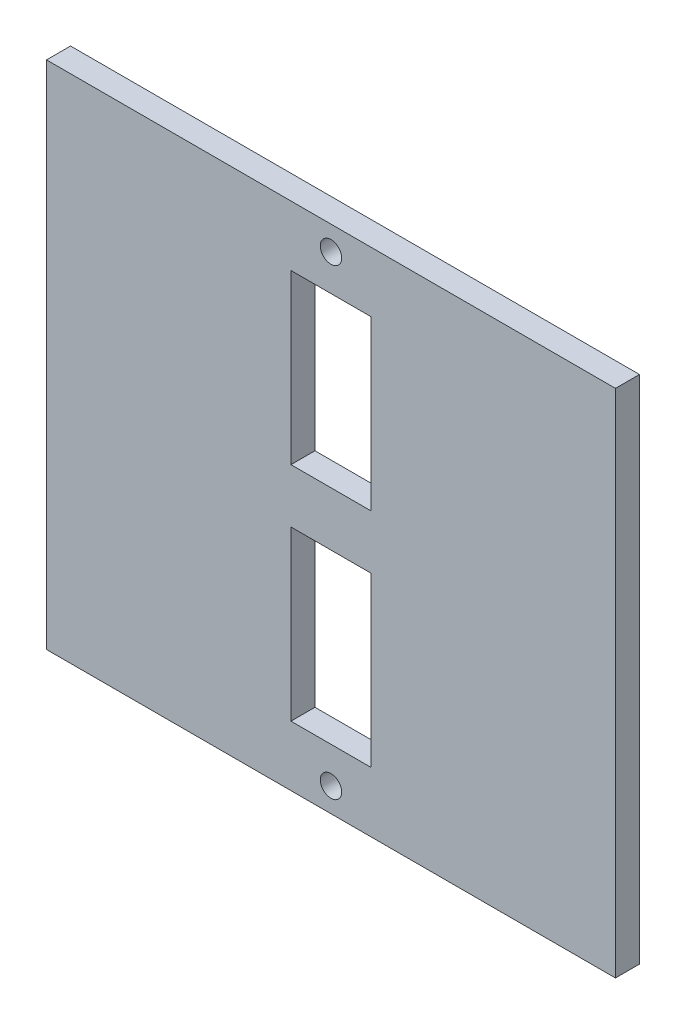
ISO-10303-21;
HEADER;
FILE_DESCRIPTION(('STEP AP214'),'2;1');
FILE_NAME('part.step','',(''),(''),'','','');
FILE_SCHEMA(('AUTOMOTIVE_DESIGN { 1 0 10303 214 1 1 1 1 }'));
ENDSEC;
DATA;
#1=APPLICATION_CONTEXT('core data for automotive mechanical design processes');
#2=APPLICATION_PROTOCOL_DEFINITION('international standard','automotive_design',2000,#1);
#3=PRODUCT_CONTEXT('',#1,'mechanical');
#4=PRODUCT('Part','Part','',(#3));
#5=PRODUCT_RELATED_PRODUCT_CATEGORY('part','',(#4));
#6=PRODUCT_DEFINITION_FORMATION('','',#4);
#7=PRODUCT_DEFINITION_CONTEXT('part definition',#1,'design');
#8=PRODUCT_DEFINITION('design','',#6,#7);
#9=PRODUCT_DEFINITION_SHAPE('','',#8);
#10=(LENGTH_UNIT() NAMED_UNIT(*) SI_UNIT(.MILLI.,.METRE.));
#11=(NAMED_UNIT(*) PLANE_ANGLE_UNIT() SI_UNIT($,.RADIAN.));
#12=(NAMED_UNIT(*) SI_UNIT($,.STERADIAN.) SOLID_ANGLE_UNIT());
#13=UNCERTAINTY_MEASURE_WITH_UNIT(LENGTH_MEASURE(1.E-05),#10,'distance_accuracy_value','');
#14=(GEOMETRIC_REPRESENTATION_CONTEXT(3) GLOBAL_UNCERTAINTY_ASSIGNED_CONTEXT((#13)) GLOBAL_UNIT_ASSIGNED_CONTEXT((#10,
#11,#12)) REPRESENTATION_CONTEXT('',''));
#15=CARTESIAN_POINT('',(0.,0.,0.));
#16=DIRECTION('',(0.,0.,1.));
#17=DIRECTION('',(1.,0.,0.));
#18=AXIS2_PLACEMENT_3D('',#15,#16,#17);
#19=CARTESIAN_POINT('',(0.,0.,3.175));
#20=DIRECTION('',(0.,0.,1.));
#21=DIRECTION('',(1.,0.,0.));
#22=AXIS2_PLACEMENT_3D('',#19,#20,#21);
#23=PLANE('',#22);
#24=CARTESIAN_POINT('',(0.,30.5530194846605,3.175));
#25=DIRECTION('',(0.,0.,1.));
#26=DIRECTION('',(1.,0.,0.));
#27=AXIS2_PLACEMENT_3D('',#24,#25,#26);
#28=CIRCLE('',#27,1.415);
#29=CARTESIAN_POINT('',(1.415,30.5530194846605,3.175));
#30=VERTEX_POINT('',#29);
#31=EDGE_CURVE('E221',#30,#30,#28,.T.);
#32=ORIENTED_EDGE('',*,*,#31,.F.);
#33=EDGE_LOOP('',(#32));
#34=FACE_BOUND('',#33,.T.);
#35=CARTESIAN_POINT('',(0.,-30.5530194846605,3.175));
#36=DIRECTION('',(0.,0.,1.));
#37=DIRECTION('',(-1.,0.,0.));
#38=AXIS2_PLACEMENT_3D('',#35,#36,#37);
#39=CIRCLE('',#38,1.415);
#40=CARTESIAN_POINT('',(-1.41499999999999,-30.5530194846605,3.175));
#41=VERTEX_POINT('',#40);
#42=EDGE_CURVE('E226',#41,#41,#39,.T.);
#43=ORIENTED_EDGE('',*,*,#42,.F.);
#44=EDGE_LOOP('',(#43));
#45=FACE_BOUND('',#44,.T.);
#46=DIRECTION('',(0.,1.,0.));
#47=VECTOR('',#46,1.);
#48=CARTESIAN_POINT('',(37.585,33.735,3.175));
#49=LINE('',#48,#47);
#50=CARTESIAN_POINT('',(37.585,-33.735,3.175));
#51=VERTEX_POINT('',#50);
#52=CARTESIAN_POINT('',(37.585,33.735,3.175));
#53=VERTEX_POINT('',#52);
#54=EDGE_CURVE('E195',#51,#53,#49,.T.);
#55=ORIENTED_EDGE('',*,*,#54,.T.);
#56=DIRECTION('',(-1.,0.,0.));
#57=VECTOR('',#56,1.);
#58=CARTESIAN_POINT('',(-37.585,33.735,3.175));
#59=LINE('',#58,#57);
#60=CARTESIAN_POINT('',(-37.585,33.735,3.175));
#61=VERTEX_POINT('',#60);
#62=EDGE_CURVE('E198',#53,#61,#59,.T.);
#63=ORIENTED_EDGE('',*,*,#62,.T.);
#64=DIRECTION('',(0.,-1.,0.));
#65=VECTOR('',#64,1.);
#66=CARTESIAN_POINT('',(-37.585,33.735,3.175));
#67=LINE('',#66,#65);
#68=CARTESIAN_POINT('',(-37.585,-33.735,3.175));
#69=VERTEX_POINT('',#68);
#70=EDGE_CURVE('E201',#61,#69,#67,.T.);
#71=ORIENTED_EDGE('',*,*,#70,.T.);
#72=DIRECTION('',(1.,0.,0.));
#73=VECTOR('',#72,1.);
#74=CARTESIAN_POINT('',(-37.585,-33.735,3.175));
#75=LINE('',#74,#73);
#76=EDGE_CURVE('E203',#69,#51,#75,.T.);
#77=ORIENTED_EDGE('',*,*,#76,.T.);
#78=EDGE_LOOP('',(#55,#63,#71,#77));
#79=FACE_BOUND('',#78,.T.);
#80=DIRECTION('',(-1.,0.,0.));
#81=VECTOR('',#80,1.);
#82=CARTESIAN_POINT('',(-5.29000000000001,25.7841584263148,3.175));
#83=LINE('',#82,#81);
#84=CARTESIAN_POINT('',(5.28999999999999,25.7841584263148,3.175));
#85=VERTEX_POINT('',#84);
#86=CARTESIAN_POINT('',(-5.29000000000001,25.7841584263148,3.175));
#87=VERTEX_POINT('',#86);
#88=EDGE_CURVE('E166',#85,#87,#83,.T.);
#89=ORIENTED_EDGE('',*,*,#88,.F.);
#90=DIRECTION('',(0.,1.,0.));
#91=VECTOR('',#90,1.);
#92=CARTESIAN_POINT('',(5.28999999999999,3.56584157368514,3.175));
#93=LINE('',#92,#91);
#94=CARTESIAN_POINT('',(5.28999999999999,3.56584157368514,3.175));
#95=VERTEX_POINT('',#94);
#96=EDGE_CURVE('E164',#95,#85,#93,.T.);
#97=ORIENTED_EDGE('',*,*,#96,.F.);
#98=DIRECTION('',(1.,0.,0.));
#99=VECTOR('',#98,1.);
#100=CARTESIAN_POINT('',(-5.29000000000001,3.56584157368514,3.175));
#101=LINE('',#100,#99);
#102=CARTESIAN_POINT('',(-5.29000000000001,3.56584157368514,3.175));
#103=VERTEX_POINT('',#102);
#104=EDGE_CURVE('E172',#103,#95,#101,.T.);
#105=ORIENTED_EDGE('',*,*,#104,.F.);
#106=DIRECTION('',(0.,-1.,0.));
#107=VECTOR('',#106,1.);
#108=CARTESIAN_POINT('',(-5.29000000000001,3.56584157368514,3.175));
#109=LINE('',#108,#107);
#110=EDGE_CURVE('E169',#87,#103,#109,.T.);
#111=ORIENTED_EDGE('',*,*,#110,.F.);
#112=EDGE_LOOP('',(#89,#97,#105,#111));
#113=FACE_BOUND('',#112,.T.);
#114=DIRECTION('',(1.,0.,0.));
#115=VECTOR('',#114,1.);
#116=CARTESIAN_POINT('',(-5.29000000000001,-25.7841584263149,3.175));
#117=LINE('',#116,#115);
#118=CARTESIAN_POINT('',(-5.29000000000001,-25.7841584263149,3.175));
#119=VERTEX_POINT('',#118);
#120=CARTESIAN_POINT('',(5.28999999999999,-25.7841584263149,3.175));
#121=VERTEX_POINT('',#120);
#122=EDGE_CURVE('E135',#119,#121,#117,.T.);
#123=ORIENTED_EDGE('',*,*,#122,.F.);
#124=DIRECTION('',(0.,-1.,0.));
#125=VECTOR('',#124,1.);
#126=CARTESIAN_POINT('',(-5.29000000000001,-3.56584157368515,3.175));
#127=LINE('',#126,#125);
#128=CARTESIAN_POINT('',(-5.29000000000001,-3.56584157368515,3.175));
#129=VERTEX_POINT('',#128);
#130=EDGE_CURVE('E127',#129,#119,#127,.T.);
#131=ORIENTED_EDGE('',*,*,#130,.F.);
#132=DIRECTION('',(-1.,0.,0.));
#133=VECTOR('',#132,1.);
#134=CARTESIAN_POINT('',(-5.29000000000001,-3.56584157368515,3.175));
#135=LINE('',#134,#133);
#136=CARTESIAN_POINT('',(5.28999999999999,-3.56584157368515,3.175));
#137=VERTEX_POINT('',#136);
#138=EDGE_CURVE('E149',#137,#129,#135,.T.);
#139=ORIENTED_EDGE('',*,*,#138,.F.);
#140=DIRECTION('',(0.,1.,0.));
#141=VECTOR('',#140,1.);
#142=CARTESIAN_POINT('',(5.28999999999999,-3.56584157368515,3.175));
#143=LINE('',#142,#141);
#144=EDGE_CURVE('E147',#121,#137,#143,.T.);
#145=ORIENTED_EDGE('',*,*,#144,.F.);
#146=EDGE_LOOP('',(#123,#131,#139,#145));
#147=FACE_BOUND('',#146,.T.);
#148=ADVANCED_FACE('F36',(#34,#45,#79,#113,#147),#23,.T.);
#149=CARTESIAN_POINT('',(0.,0.,0.));
#150=DIRECTION('',(0.,0.,1.));
#151=DIRECTION('',(1.,0.,0.));
#152=AXIS2_PLACEMENT_3D('',#149,#150,#151);
#153=PLANE('',#152);
#154=CARTESIAN_POINT('',(0.,30.5530194846605,0.));
#155=DIRECTION('',(0.,0.,1.));
#156=DIRECTION('',(1.,0.,0.));
#157=AXIS2_PLACEMENT_3D('',#154,#155,#156);
#158=CIRCLE('',#157,1.415);
#159=CARTESIAN_POINT('',(1.415,30.5530194846605,0.));
#160=VERTEX_POINT('',#159);
#161=EDGE_CURVE('E40',#160,#160,#158,.T.);
#162=ORIENTED_EDGE('',*,*,#161,.T.);
#163=EDGE_LOOP('',(#162));
#164=FACE_BOUND('',#163,.T.);
#165=CARTESIAN_POINT('',(0.,-30.5530194846605,0.));
#166=DIRECTION('',(0.,0.,1.));
#167=DIRECTION('',(1.,0.,0.));
#168=AXIS2_PLACEMENT_3D('',#165,#166,#167);
#169=CIRCLE('',#168,1.415);
#170=CARTESIAN_POINT('',(1.41500000000001,-30.5530194846605,0.));
#171=VERTEX_POINT('',#170);
#172=EDGE_CURVE('E219',#171,#171,#169,.T.);
#173=ORIENTED_EDGE('',*,*,#172,.T.);
#174=EDGE_LOOP('',(#173));
#175=FACE_BOUND('',#174,.T.);
#176=DIRECTION('',(0.,1.,0.));
#177=VECTOR('',#176,1.);
#178=CARTESIAN_POINT('',(5.28999999999999,3.56584157368514,0.));
#179=LINE('',#178,#177);
#180=CARTESIAN_POINT('',(5.28999999999999,3.56584157368514,0.));
#181=VERTEX_POINT('',#180);
#182=CARTESIAN_POINT('',(5.28999999999999,25.7841584263148,0.));
#183=VERTEX_POINT('',#182);
#184=EDGE_CURVE('E143',#181,#183,#179,.T.);
#185=ORIENTED_EDGE('',*,*,#184,.T.);
#186=DIRECTION('',(-1.,0.,0.));
#187=VECTOR('',#186,1.);
#188=CARTESIAN_POINT('',(-5.29000000000001,25.7841584263148,0.));
#189=LINE('',#188,#187);
#190=CARTESIAN_POINT('',(-5.29000000000001,25.7841584263148,0.));
#191=VERTEX_POINT('',#190);
#192=EDGE_CURVE('E177',#183,#191,#189,.T.);
#193=ORIENTED_EDGE('',*,*,#192,.T.);
#194=DIRECTION('',(0.,-1.,0.));
#195=VECTOR('',#194,1.);
#196=CARTESIAN_POINT('',(-5.29000000000001,3.56584157368514,0.));
#197=LINE('',#196,#195);
#198=CARTESIAN_POINT('',(-5.29000000000001,3.56584157368514,0.));
#199=VERTEX_POINT('',#198);
#200=EDGE_CURVE('E180',#191,#199,#197,.T.);
#201=ORIENTED_EDGE('',*,*,#200,.T.);
#202=DIRECTION('',(1.,0.,0.));
#203=VECTOR('',#202,1.);
#204=CARTESIAN_POINT('',(-5.29000000000001,3.56584157368514,0.));
#205=LINE('',#204,#203);
#206=EDGE_CURVE('E167',#199,#181,#205,.T.);
#207=ORIENTED_EDGE('',*,*,#206,.T.);
#208=EDGE_LOOP('',(#185,#193,#201,#207));
#209=FACE_BOUND('',#208,.T.);
#210=DIRECTION('',(0.,1.,0.));
#211=VECTOR('',#210,1.);
#212=CARTESIAN_POINT('',(37.585,33.735,0.));
#213=LINE('',#212,#211);
#214=CARTESIAN_POINT('',(37.585,-33.735,0.));
#215=VERTEX_POINT('',#214);
#216=CARTESIAN_POINT('',(37.585,33.735,0.));
#217=VERTEX_POINT('',#216);
#218=EDGE_CURVE('E194',#215,#217,#213,.T.);
#219=ORIENTED_EDGE('',*,*,#218,.F.);
#220=DIRECTION('',(1.,0.,0.));
#221=VECTOR('',#220,1.);
#222=CARTESIAN_POINT('',(-37.585,-33.735,0.));
#223=LINE('',#222,#221);
#224=CARTESIAN_POINT('',(-37.585,-33.735,0.));
#225=VERTEX_POINT('',#224);
#226=EDGE_CURVE('E199',#225,#215,#223,.T.);
#227=ORIENTED_EDGE('',*,*,#226,.F.);
#228=DIRECTION('',(0.,-1.,0.));
#229=VECTOR('',#228,1.);
#230=CARTESIAN_POINT('',(-37.585,33.735,0.));
#231=LINE('',#230,#229);
#232=CARTESIAN_POINT('',(-37.585,33.735,0.));
#233=VERTEX_POINT('',#232);
#234=EDGE_CURVE('E210',#233,#225,#231,.T.);
#235=ORIENTED_EDGE('',*,*,#234,.F.);
#236=DIRECTION('',(-1.,0.,0.));
#237=VECTOR('',#236,1.);
#238=CARTESIAN_POINT('',(-37.585,33.735,0.));
#239=LINE('',#238,#237);
#240=EDGE_CURVE('E208',#217,#233,#239,.T.);
#241=ORIENTED_EDGE('',*,*,#240,.F.);
#242=EDGE_LOOP('',(#219,#227,#235,#241));
#243=FACE_BOUND('',#242,.T.);
#244=DIRECTION('',(0.,-1.,0.));
#245=VECTOR('',#244,1.);
#246=CARTESIAN_POINT('',(-5.29000000000001,-3.56584157368515,0.));
#247=LINE('',#246,#245);
#248=CARTESIAN_POINT('',(-5.29000000000001,-3.56584157368515,0.));
#249=VERTEX_POINT('',#248);
#250=CARTESIAN_POINT('',(-5.29000000000001,-25.7841584263149,0.));
#251=VERTEX_POINT('',#250);
#252=EDGE_CURVE('E61',#249,#251,#247,.T.);
#253=ORIENTED_EDGE('',*,*,#252,.T.);
#254=DIRECTION('',(1.,0.,0.));
#255=VECTOR('',#254,1.);
#256=CARTESIAN_POINT('',(-5.29000000000001,-25.7841584263149,0.));
#257=LINE('',#256,#255);
#258=CARTESIAN_POINT('',(5.28999999999999,-25.7841584263149,0.));
#259=VERTEX_POINT('',#258);
#260=EDGE_CURVE('E142',#251,#259,#257,.T.);
#261=ORIENTED_EDGE('',*,*,#260,.T.);
#262=DIRECTION('',(0.,1.,0.));
#263=VECTOR('',#262,1.);
#264=CARTESIAN_POINT('',(5.28999999999999,-3.56584157368515,0.));
#265=LINE('',#264,#263);
#266=CARTESIAN_POINT('',(5.28999999999999,-3.56584157368515,0.));
#267=VERTEX_POINT('',#266);
#268=EDGE_CURVE('E156',#259,#267,#265,.T.);
#269=ORIENTED_EDGE('',*,*,#268,.T.);
#270=DIRECTION('',(-1.,0.,0.));
#271=VECTOR('',#270,1.);
#272=CARTESIAN_POINT('',(-5.29000000000001,-3.56584157368515,0.));
#273=LINE('',#272,#271);
#274=EDGE_CURVE('E136',#267,#249,#273,.T.);
#275=ORIENTED_EDGE('',*,*,#274,.T.);
#276=EDGE_LOOP('',(#253,#261,#269,#275));
#277=FACE_BOUND('',#276,.T.);
#278=ADVANCED_FACE('F238',(#164,#175,#209,#243,#277),#153,.F.);
#279=CARTESIAN_POINT('',(37.585,33.735,3.175));
#280=DIRECTION('',(-1.,0.,0.));
#281=DIRECTION('',(0.,0.,1.));
#282=AXIS2_PLACEMENT_3D('',#279,#280,#281);
#283=PLANE('',#282);
#284=ORIENTED_EDGE('',*,*,#218,.T.);
#285=DIRECTION('',(0.,0.,-1.));
#286=VECTOR('',#285,1.);
#287=CARTESIAN_POINT('',(37.585,33.735,3.175));
#288=LINE('',#287,#286);
#289=EDGE_CURVE('E11',#53,#217,#288,.T.);
#290=ORIENTED_EDGE('',*,*,#289,.F.);
#291=ORIENTED_EDGE('',*,*,#54,.F.);
#292=DIRECTION('',(0.,0.,-1.));
#293=VECTOR('',#292,1.);
#294=CARTESIAN_POINT('',(37.585,-33.735,3.175));
#295=LINE('',#294,#293);
#296=EDGE_CURVE('E205',#51,#215,#295,.T.);
#297=ORIENTED_EDGE('',*,*,#296,.T.);
#298=EDGE_LOOP('',(#284,#290,#291,#297));
#299=FACE_BOUND('',#298,.T.);
#300=ADVANCED_FACE('F38',(#299),#283,.F.);
#301=CARTESIAN_POINT('',(-37.585,33.735,3.175));
#302=DIRECTION('',(0.,-1.,0.));
#303=DIRECTION('',(0.,0.,-1.));
#304=AXIS2_PLACEMENT_3D('',#301,#302,#303);
#305=PLANE('',#304);
#306=ORIENTED_EDGE('',*,*,#240,.T.);
#307=DIRECTION('',(0.,0.,-1.));
#308=VECTOR('',#307,1.);
#309=CARTESIAN_POINT('',(-37.585,33.735,3.175));
#310=LINE('',#309,#308);
#311=EDGE_CURVE('E45',#61,#233,#310,.T.);
#312=ORIENTED_EDGE('',*,*,#311,.F.);
#313=ORIENTED_EDGE('',*,*,#62,.F.);
#314=ORIENTED_EDGE('',*,*,#289,.T.);
#315=EDGE_LOOP('',(#306,#312,#313,#314));
#316=FACE_BOUND('',#315,.T.);
#317=ADVANCED_FACE('F286',(#316),#305,.F.);
#318=CARTESIAN_POINT('',(-37.585,33.735,3.175));
#319=DIRECTION('',(1.,0.,0.));
#320=DIRECTION('',(0.,0.,-1.));
#321=AXIS2_PLACEMENT_3D('',#318,#319,#320);
#322=PLANE('',#321);
#323=ORIENTED_EDGE('',*,*,#234,.T.);
#324=DIRECTION('',(0.,0.,-1.));
#325=VECTOR('',#324,1.);
#326=CARTESIAN_POINT('',(-37.585,-33.735,3.175));
#327=LINE('',#326,#325);
#328=EDGE_CURVE('E215',#69,#225,#327,.T.);
#329=ORIENTED_EDGE('',*,*,#328,.F.);
#330=ORIENTED_EDGE('',*,*,#70,.F.);
#331=ORIENTED_EDGE('',*,*,#311,.T.);
#332=EDGE_LOOP('',(#323,#329,#330,#331));
#333=FACE_BOUND('',#332,.T.);
#334=ADVANCED_FACE('F283',(#333),#322,.F.);
#335=CARTESIAN_POINT('',(-37.585,-33.735,3.175));
#336=DIRECTION('',(0.,1.,0.));
#337=DIRECTION('',(0.,0.,1.));
#338=AXIS2_PLACEMENT_3D('',#335,#336,#337);
#339=PLANE('',#338);
#340=ORIENTED_EDGE('',*,*,#226,.T.);
#341=ORIENTED_EDGE('',*,*,#296,.F.);
#342=ORIENTED_EDGE('',*,*,#76,.F.);
#343=ORIENTED_EDGE('',*,*,#328,.T.);
#344=EDGE_LOOP('',(#340,#341,#342,#343));
#345=FACE_BOUND('',#344,.T.);
#346=ADVANCED_FACE('F276',(#345),#339,.F.);
#347=CARTESIAN_POINT('',(5.28999999999999,3.56584157368514,3.175));
#348=DIRECTION('',(-1.,0.,0.));
#349=DIRECTION('',(0.,0.,1.));
#350=AXIS2_PLACEMENT_3D('',#347,#348,#349);
#351=PLANE('',#350);
#352=ORIENTED_EDGE('',*,*,#184,.F.);
#353=DIRECTION('',(0.,0.,-1.));
#354=VECTOR('',#353,1.);
#355=CARTESIAN_POINT('',(5.28999999999999,3.56584157368514,3.175));
#356=LINE('',#355,#354);
#357=EDGE_CURVE('E174',#95,#181,#356,.T.);
#358=ORIENTED_EDGE('',*,*,#357,.F.);
#359=ORIENTED_EDGE('',*,*,#96,.T.);
#360=DIRECTION('',(0.,0.,-1.));
#361=VECTOR('',#360,1.);
#362=CARTESIAN_POINT('',(5.28999999999999,25.7841584263148,3.175));
#363=LINE('',#362,#361);
#364=EDGE_CURVE('E191',#85,#183,#363,.T.);
#365=ORIENTED_EDGE('',*,*,#364,.T.);
#366=EDGE_LOOP('',(#352,#358,#359,#365));
#367=FACE_BOUND('',#366,.T.);
#368=ADVANCED_FACE('F259',(#367),#351,.T.);
#369=CARTESIAN_POINT('',(-5.29000000000001,25.7841584263148,3.175));
#370=DIRECTION('',(0.,-1.,0.));
#371=DIRECTION('',(0.,0.,-1.));
#372=AXIS2_PLACEMENT_3D('',#369,#370,#371);
#373=PLANE('',#372);
#374=ORIENTED_EDGE('',*,*,#192,.F.);
#375=ORIENTED_EDGE('',*,*,#364,.F.);
#376=ORIENTED_EDGE('',*,*,#88,.T.);
#377=DIRECTION('',(0.,0.,-1.));
#378=VECTOR('',#377,1.);
#379=CARTESIAN_POINT('',(-5.29000000000001,25.7841584263148,3.175));
#380=LINE('',#379,#378);
#381=EDGE_CURVE('E189',#87,#191,#380,.T.);
#382=ORIENTED_EDGE('',*,*,#381,.T.);
#383=EDGE_LOOP('',(#374,#375,#376,#382));
#384=FACE_BOUND('',#383,.T.);
#385=ADVANCED_FACE('F251',(#384),#373,.T.);
#386=CARTESIAN_POINT('',(-5.29000000000001,3.56584157368514,3.175));
#387=DIRECTION('',(1.,0.,0.));
#388=DIRECTION('',(0.,0.,-1.));
#389=AXIS2_PLACEMENT_3D('',#386,#387,#388);
#390=PLANE('',#389);
#391=ORIENTED_EDGE('',*,*,#200,.F.);
#392=ORIENTED_EDGE('',*,*,#381,.F.);
#393=ORIENTED_EDGE('',*,*,#110,.T.);
#394=DIRECTION('',(0.,0.,-1.));
#395=VECTOR('',#394,1.);
#396=CARTESIAN_POINT('',(-5.29000000000001,3.56584157368514,3.175));
#397=LINE('',#396,#395);
#398=EDGE_CURVE('E187',#103,#199,#397,.T.);
#399=ORIENTED_EDGE('',*,*,#398,.T.);
#400=EDGE_LOOP('',(#391,#392,#393,#399));
#401=FACE_BOUND('',#400,.T.);
#402=ADVANCED_FACE('F254',(#401),#390,.T.);
#403=CARTESIAN_POINT('',(-5.29000000000001,3.56584157368514,3.175));
#404=DIRECTION('',(0.,1.,0.));
#405=DIRECTION('',(0.,0.,1.));
#406=AXIS2_PLACEMENT_3D('',#403,#404,#405);
#407=PLANE('',#406);
#408=ORIENTED_EDGE('',*,*,#206,.F.);
#409=ORIENTED_EDGE('',*,*,#398,.F.);
#410=ORIENTED_EDGE('',*,*,#104,.T.);
#411=ORIENTED_EDGE('',*,*,#357,.T.);
#412=EDGE_LOOP('',(#408,#409,#410,#411));
#413=FACE_BOUND('',#412,.T.);
#414=ADVANCED_FACE('F262',(#413),#407,.T.);
#415=CARTESIAN_POINT('',(-5.29000000000001,-3.56584157368515,3.175));
#416=DIRECTION('',(1.,0.,0.));
#417=DIRECTION('',(0.,0.,-1.));
#418=AXIS2_PLACEMENT_3D('',#415,#416,#417);
#419=PLANE('',#418);
#420=ORIENTED_EDGE('',*,*,#252,.F.);
#421=DIRECTION('',(0.,0.,-1.));
#422=VECTOR('',#421,1.);
#423=CARTESIAN_POINT('',(-5.29000000000001,-3.56584157368515,3.175));
#424=LINE('',#423,#422);
#425=EDGE_CURVE('E131',#129,#249,#424,.T.);
#426=ORIENTED_EDGE('',*,*,#425,.F.);
#427=ORIENTED_EDGE('',*,*,#130,.T.);
#428=DIRECTION('',(0.,0.,-1.));
#429=VECTOR('',#428,1.);
#430=CARTESIAN_POINT('',(-5.29000000000001,-25.7841584263149,3.175));
#431=LINE('',#430,#429);
#432=EDGE_CURVE('E130',#119,#251,#431,.T.);
#433=ORIENTED_EDGE('',*,*,#432,.T.);
#434=EDGE_LOOP('',(#420,#426,#427,#433));
#435=FACE_BOUND('',#434,.T.);
#436=ADVANCED_FACE('F129',(#435),#419,.T.);
#437=CARTESIAN_POINT('',(-5.29000000000001,-25.7841584263149,3.175));
#438=DIRECTION('',(0.,1.,0.));
#439=DIRECTION('',(0.,0.,1.));
#440=AXIS2_PLACEMENT_3D('',#437,#438,#439);
#441=PLANE('',#440);
#442=ORIENTED_EDGE('',*,*,#260,.F.);
#443=ORIENTED_EDGE('',*,*,#432,.F.);
#444=ORIENTED_EDGE('',*,*,#122,.T.);
#445=DIRECTION('',(0.,0.,-1.));
#446=VECTOR('',#445,1.);
#447=CARTESIAN_POINT('',(5.28999999999999,-25.7841584263149,3.175));
#448=LINE('',#447,#446);
#449=EDGE_CURVE('E144',#121,#259,#448,.T.);
#450=ORIENTED_EDGE('',*,*,#449,.T.);
#451=EDGE_LOOP('',(#442,#443,#444,#450));
#452=FACE_BOUND('',#451,.T.);
#453=ADVANCED_FACE('F139',(#452),#441,.T.);
#454=CARTESIAN_POINT('',(5.28999999999999,-3.56584157368515,3.175));
#455=DIRECTION('',(-1.,0.,0.));
#456=DIRECTION('',(0.,0.,1.));
#457=AXIS2_PLACEMENT_3D('',#454,#455,#456);
#458=PLANE('',#457);
#459=ORIENTED_EDGE('',*,*,#268,.F.);
#460=ORIENTED_EDGE('',*,*,#449,.F.);
#461=ORIENTED_EDGE('',*,*,#144,.T.);
#462=DIRECTION('',(0.,0.,-1.));
#463=VECTOR('',#462,1.);
#464=CARTESIAN_POINT('',(5.28999999999999,-3.56584157368515,3.175));
#465=LINE('',#464,#463);
#466=EDGE_CURVE('E53',#137,#267,#465,.T.);
#467=ORIENTED_EDGE('',*,*,#466,.T.);
#468=EDGE_LOOP('',(#459,#460,#461,#467));
#469=FACE_BOUND('',#468,.T.);
#470=ADVANCED_FACE('F306',(#469),#458,.T.);
#471=CARTESIAN_POINT('',(-5.29000000000001,-3.56584157368515,3.175));
#472=DIRECTION('',(0.,-1.,0.));
#473=DIRECTION('',(0.,0.,-1.));
#474=AXIS2_PLACEMENT_3D('',#471,#472,#473);
#475=PLANE('',#474);
#476=ORIENTED_EDGE('',*,*,#274,.F.);
#477=ORIENTED_EDGE('',*,*,#466,.F.);
#478=ORIENTED_EDGE('',*,*,#138,.T.);
#479=ORIENTED_EDGE('',*,*,#425,.T.);
#480=EDGE_LOOP('',(#476,#477,#478,#479));
#481=FACE_BOUND('',#480,.T.);
#482=ADVANCED_FACE('F304',(#481),#475,.T.);
#483=CARTESIAN_POINT('',(0.,-30.5530194846605,-6.825));
#484=DIRECTION('',(0.,0.,1.));
#485=DIRECTION('',(1.,0.,0.));
#486=AXIS2_PLACEMENT_3D('',#483,#484,#485);
#487=CYLINDRICAL_SURFACE('',#486,1.415);
#488=ORIENTED_EDGE('',*,*,#42,.T.);
#489=EDGE_LOOP('',(#488));
#490=FACE_BOUND('',#489,.T.);
#491=ORIENTED_EDGE('',*,*,#172,.F.);
#492=EDGE_LOOP('',(#491));
#493=FACE_BOUND('',#492,.T.);
#494=ADVANCED_FACE('F233',(#490,#493),#487,.F.);
#495=CARTESIAN_POINT('',(0.,30.5530194846605,-6.825));
#496=DIRECTION('',(0.,0.,1.));
#497=DIRECTION('',(1.,0.,0.));
#498=AXIS2_PLACEMENT_3D('',#495,#496,#497);
#499=CYLINDRICAL_SURFACE('',#498,1.415);
#500=ORIENTED_EDGE('',*,*,#31,.T.);
#501=EDGE_LOOP('',(#500));
#502=FACE_BOUND('',#501,.T.);
#503=ORIENTED_EDGE('',*,*,#161,.F.);
#504=EDGE_LOOP('',(#503));
#505=FACE_BOUND('',#504,.T.);
#506=ADVANCED_FACE('F312',(#502,#505),#499,.F.);
#507=CLOSED_SHELL('',(#148,#278,#300,#317,#334,#346,#368,#385,#402,#414,#436,#453,#470,#482,
#494,#506));
#508=MANIFOLD_SOLID_BREP('B2',#507);
#509=ADVANCED_BREP_SHAPE_REPRESENTATION('',(#18,#508),#14);
#510=SHAPE_DEFINITION_REPRESENTATION(#9,#509);
ENDSEC;
END-ISO-10303-21;
